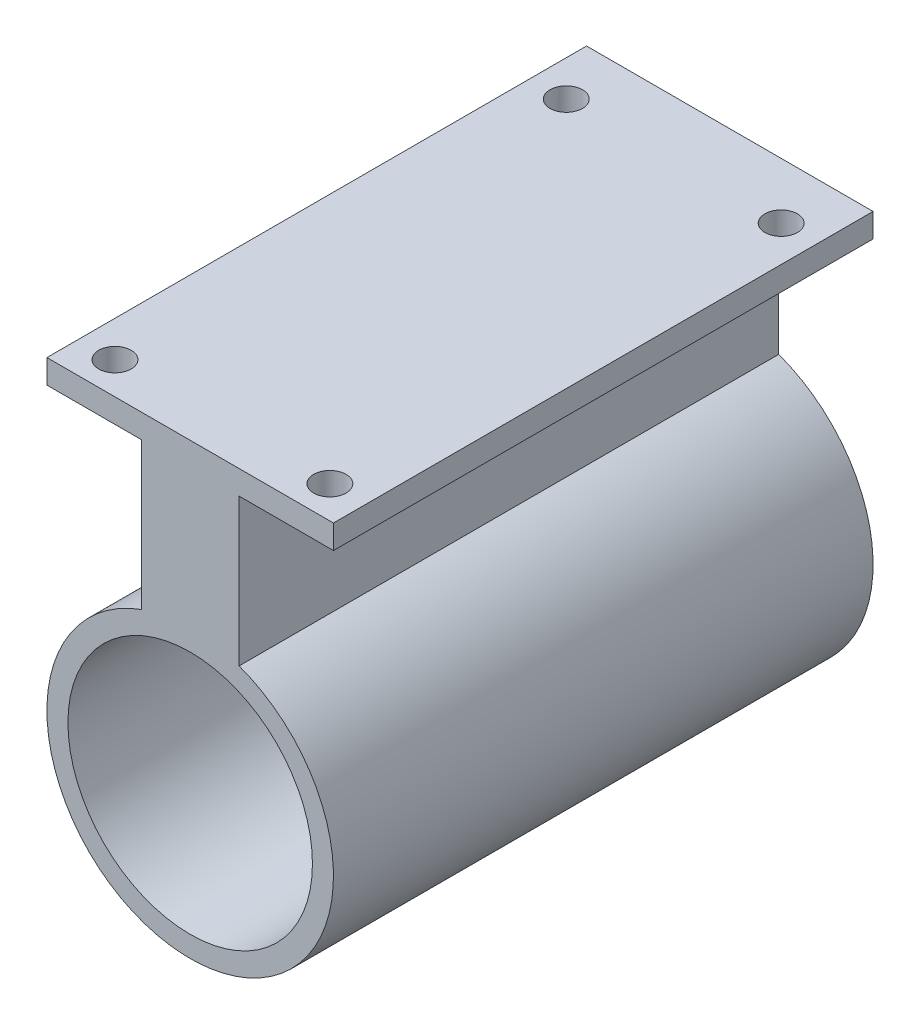
ISO-10303-21;
HEADER;
FILE_DESCRIPTION(('STEP AP214'),'2;1');
FILE_NAME('part.step','',(''),(''),'','','');
FILE_SCHEMA(('AUTOMOTIVE_DESIGN { 1 0 10303 214 1 1 1 1 }'));
ENDSEC;
DATA;
#1=APPLICATION_CONTEXT('core data for automotive mechanical design processes');
#2=APPLICATION_PROTOCOL_DEFINITION('international standard','automotive_design',2000,#1);
#3=PRODUCT_CONTEXT('',#1,'mechanical');
#4=PRODUCT('Part','Part','',(#3));
#5=PRODUCT_RELATED_PRODUCT_CATEGORY('part','',(#4));
#6=PRODUCT_DEFINITION_FORMATION('','',#4);
#7=PRODUCT_DEFINITION_CONTEXT('part definition',#1,'design');
#8=PRODUCT_DEFINITION('design','',#6,#7);
#9=PRODUCT_DEFINITION_SHAPE('','',#8);
#10=(LENGTH_UNIT() NAMED_UNIT(*) SI_UNIT(.MILLI.,.METRE.));
#11=(NAMED_UNIT(*) PLANE_ANGLE_UNIT() SI_UNIT($,.RADIAN.));
#12=(NAMED_UNIT(*) SI_UNIT($,.STERADIAN.) SOLID_ANGLE_UNIT());
#13=UNCERTAINTY_MEASURE_WITH_UNIT(LENGTH_MEASURE(1.E-05),#10,'distance_accuracy_value','');
#14=(GEOMETRIC_REPRESENTATION_CONTEXT(3) GLOBAL_UNCERTAINTY_ASSIGNED_CONTEXT((#13)) GLOBAL_UNIT_ASSIGNED_CONTEXT((#10,
#11,#12)) REPRESENTATION_CONTEXT('',''));
#15=CARTESIAN_POINT('',(0.,0.,0.));
#16=DIRECTION('',(0.,0.,1.));
#17=DIRECTION('',(1.,0.,0.));
#18=AXIS2_PLACEMENT_3D('',#15,#16,#17);
#19=CARTESIAN_POINT('',(0.,-30.75,54.));
#20=DIRECTION('',(0.,0.,-1.));
#21=DIRECTION('',(-1.,0.,0.));
#22=AXIS2_PLACEMENT_3D('',#19,#20,#21);
#23=CYLINDRICAL_SURFACE('',#22,15.);
#24=CARTESIAN_POINT('',(0.,-30.75,-2.5));
#25=DIRECTION('',(0.,0.,-1.));
#26=DIRECTION('',(-1.,0.,0.));
#27=AXIS2_PLACEMENT_3D('',#24,#25,#26);
#28=CIRCLE('',#27,15.);
#29=CARTESIAN_POINT('',(5.11989742878924,-16.6508280271969,-2.5));
#30=VERTEX_POINT('',#29);
#31=CARTESIAN_POINT('',(-5.11989742878925,-16.6508280271969,-2.5));
#32=VERTEX_POINT('',#31);
#33=EDGE_CURVE('E150',#30,#32,#28,.T.);
#34=ORIENTED_EDGE('',*,*,#33,.F.);
#35=DIRECTION('',(0.,0.,-1.));
#36=VECTOR('',#35,1.);
#37=CARTESIAN_POINT('',(5.11989742878925,-16.6508280271969,54.));
#38=LINE('',#37,#36);
#39=CARTESIAN_POINT('',(5.11989742878925,-16.6508280271969,54.));
#40=VERTEX_POINT('',#39);
#41=EDGE_CURVE('E51',#40,#30,#38,.T.);
#42=ORIENTED_EDGE('',*,*,#41,.F.);
#43=CARTESIAN_POINT('',(0.,-30.75,54.));
#44=DIRECTION('',(0.,0.,1.));
#45=DIRECTION('',(1.,0.,0.));
#46=AXIS2_PLACEMENT_3D('',#43,#44,#45);
#47=CIRCLE('',#46,15.);
#48=CARTESIAN_POINT('',(-5.11989742878925,-16.6508280271969,54.));
#49=VERTEX_POINT('',#48);
#50=EDGE_CURVE('E160',#49,#40,#47,.T.);
#51=ORIENTED_EDGE('',*,*,#50,.F.);
#52=DIRECTION('',(0.,0.,-1.));
#53=VECTOR('',#52,1.);
#54=CARTESIAN_POINT('',(-5.11989742878925,-16.6508280271969,54.));
#55=LINE('',#54,#53);
#56=EDGE_CURVE('E172',#49,#32,#55,.T.);
#57=ORIENTED_EDGE('',*,*,#56,.T.);
#58=EDGE_LOOP('',(#34,#42,#51,#57));
#59=FACE_BOUND('',#58,.T.);
#60=ADVANCED_FACE('F34',(#59),#23,.T.);
#61=CARTESIAN_POINT('',(0.,-30.75,54.));
#62=DIRECTION('',(0.,0.,1.));
#63=DIRECTION('',(1.,0.,0.));
#64=AXIS2_PLACEMENT_3D('',#61,#62,#63);
#65=PLANE('',#64);
#66=CARTESIAN_POINT('',(0.,-30.75,54.));
#67=DIRECTION('',(0.,0.,1.));
#68=DIRECTION('',(1.,0.,0.));
#69=AXIS2_PLACEMENT_3D('',#66,#67,#68);
#70=CIRCLE('',#69,12.8);
#71=CARTESIAN_POINT('',(12.8,-30.75,54.));
#72=VERTEX_POINT('',#71);
#73=EDGE_CURVE('E132',#72,#72,#70,.T.);
#74=ORIENTED_EDGE('',*,*,#73,.F.);
#75=EDGE_LOOP('',(#74));
#76=FACE_BOUND('',#75,.T.);
#77=DIRECTION('',(0.,-1.,0.));
#78=VECTOR('',#77,1.);
#79=CARTESIAN_POINT('',(-15.,-1.25,54.));
#80=LINE('',#79,#78);
#81=CARTESIAN_POINT('',(-15.,1.25,54.));
#82=VERTEX_POINT('',#81);
#83=CARTESIAN_POINT('',(-15.,-1.25,54.));
#84=VERTEX_POINT('',#83);
#85=EDGE_CURVE('E154',#82,#84,#80,.T.);
#86=ORIENTED_EDGE('',*,*,#85,.T.);
#87=DIRECTION('',(1.,0.,0.));
#88=VECTOR('',#87,1.);
#89=CARTESIAN_POINT('',(-5.11989742878925,-1.25,54.));
#90=LINE('',#89,#88);
#91=CARTESIAN_POINT('',(-5.11989742878925,-1.25,54.));
#92=VERTEX_POINT('',#91);
#93=EDGE_CURVE('E156',#84,#92,#90,.T.);
#94=ORIENTED_EDGE('',*,*,#93,.T.);
#95=DIRECTION('',(0.,-1.,0.));
#96=VECTOR('',#95,1.);
#97=CARTESIAN_POINT('',(-5.11989742878925,-13.25,54.));
#98=LINE('',#97,#96);
#99=EDGE_CURVE('E158',#92,#49,#98,.T.);
#100=ORIENTED_EDGE('',*,*,#99,.T.);
#101=ORIENTED_EDGE('',*,*,#50,.T.);
#102=DIRECTION('',(0.,1.,0.));
#103=VECTOR('',#102,1.);
#104=CARTESIAN_POINT('',(5.11989742878925,-13.25,54.));
#105=LINE('',#104,#103);
#106=CARTESIAN_POINT('',(5.11989742878925,-1.25,54.));
#107=VERTEX_POINT('',#106);
#108=EDGE_CURVE('E162',#40,#107,#105,.T.);
#109=ORIENTED_EDGE('',*,*,#108,.T.);
#110=DIRECTION('',(1.,0.,0.));
#111=VECTOR('',#110,1.);
#112=CARTESIAN_POINT('',(15.,-1.25,54.));
#113=LINE('',#112,#111);
#114=CARTESIAN_POINT('',(15.,-1.25,54.));
#115=VERTEX_POINT('',#114);
#116=EDGE_CURVE('E164',#107,#115,#113,.T.);
#117=ORIENTED_EDGE('',*,*,#116,.T.);
#118=DIRECTION('',(0.,1.,0.));
#119=VECTOR('',#118,1.);
#120=CARTESIAN_POINT('',(15.,-1.25,54.));
#121=LINE('',#120,#119);
#122=CARTESIAN_POINT('',(15.,1.25,54.));
#123=VERTEX_POINT('',#122);
#124=EDGE_CURVE('E110',#115,#123,#121,.T.);
#125=ORIENTED_EDGE('',*,*,#124,.T.);
#126=DIRECTION('',(-1.,0.,0.));
#127=VECTOR('',#126,1.);
#128=CARTESIAN_POINT('',(15.,1.25,54.));
#129=LINE('',#128,#127);
#130=EDGE_CURVE('E59',#123,#82,#129,.T.);
#131=ORIENTED_EDGE('',*,*,#130,.T.);
#132=EDGE_LOOP('',(#86,#94,#100,#101,#109,#117,#125,#131));
#133=FACE_BOUND('',#132,.T.);
#134=ADVANCED_FACE('F187',(#76,#133),#65,.T.);
#135=CARTESIAN_POINT('',(-15.,-1.25,54.));
#136=DIRECTION('',(1.,0.,0.));
#137=DIRECTION('',(0.,0.,-1.));
#138=AXIS2_PLACEMENT_3D('',#135,#136,#137);
#139=PLANE('',#138);
#140=DIRECTION('',(0.,0.,-1.));
#141=VECTOR('',#140,1.);
#142=CARTESIAN_POINT('',(-15.,1.25,54.));
#143=LINE('',#142,#141);
#144=CARTESIAN_POINT('',(-15.,1.25,-2.5));
#145=VERTEX_POINT('',#144);
#146=EDGE_CURVE('E168',#82,#145,#143,.T.);
#147=ORIENTED_EDGE('',*,*,#146,.T.);
#148=DIRECTION('',(0.,1.,0.));
#149=VECTOR('',#148,1.);
#150=CARTESIAN_POINT('',(-15.,1.25,-2.5));
#151=LINE('',#150,#149);
#152=CARTESIAN_POINT('',(-15.,-1.25,-2.5));
#153=VERTEX_POINT('',#152);
#154=EDGE_CURVE('E143',#153,#145,#151,.T.);
#155=ORIENTED_EDGE('',*,*,#154,.F.);
#156=DIRECTION('',(0.,0.,-1.));
#157=VECTOR('',#156,1.);
#158=CARTESIAN_POINT('',(-15.,-1.25,54.));
#159=LINE('',#158,#157);
#160=EDGE_CURVE('E11',#84,#153,#159,.T.);
#161=ORIENTED_EDGE('',*,*,#160,.F.);
#162=ORIENTED_EDGE('',*,*,#85,.F.);
#163=EDGE_LOOP('',(#147,#155,#161,#162));
#164=FACE_BOUND('',#163,.T.);
#165=ADVANCED_FACE('F36',(#164),#139,.F.);
#166=CARTESIAN_POINT('',(-5.11989742878925,-1.25,54.));
#167=DIRECTION('',(0.,1.,0.));
#168=DIRECTION('',(-1.,0.,0.));
#169=AXIS2_PLACEMENT_3D('',#166,#167,#168);
#170=PLANE('',#169);
#171=CARTESIAN_POINT('',(-11.25,-1.25,50.625));
#172=DIRECTION('',(0.,1.,0.));
#173=DIRECTION('',(-1.,0.,0.));
#174=AXIS2_PLACEMENT_3D('',#171,#172,#173);
#175=CIRCLE('',#174,1.7);
#176=CARTESIAN_POINT('',(-12.95,-1.25,50.625));
#177=VERTEX_POINT('',#176);
#178=EDGE_CURVE('E228',#177,#177,#175,.T.);
#179=ORIENTED_EDGE('',*,*,#178,.T.);
#180=EDGE_LOOP('',(#179));
#181=FACE_BOUND('',#180,.T.);
#182=CARTESIAN_POINT('',(-11.25,-1.25,3.375));
#183=DIRECTION('',(0.,1.,0.));
#184=DIRECTION('',(-1.,0.,0.));
#185=AXIS2_PLACEMENT_3D('',#182,#183,#184);
#186=CIRCLE('',#185,1.7);
#187=CARTESIAN_POINT('',(-12.95,-1.25,3.375));
#188=VERTEX_POINT('',#187);
#189=EDGE_CURVE('E231',#188,#188,#186,.T.);
#190=ORIENTED_EDGE('',*,*,#189,.T.);
#191=EDGE_LOOP('',(#190));
#192=FACE_BOUND('',#191,.T.);
#193=ORIENTED_EDGE('',*,*,#160,.T.);
#194=DIRECTION('',(-1.,0.,0.));
#195=VECTOR('',#194,1.);
#196=CARTESIAN_POINT('',(-15.,-1.25,-2.5));
#197=LINE('',#196,#195);
#198=CARTESIAN_POINT('',(-5.11989742878925,-1.25,-2.5));
#199=VERTEX_POINT('',#198);
#200=EDGE_CURVE('E140',#199,#153,#197,.T.);
#201=ORIENTED_EDGE('',*,*,#200,.F.);
#202=DIRECTION('',(0.,0.,-1.));
#203=VECTOR('',#202,1.);
#204=CARTESIAN_POINT('',(-5.11989742878925,-1.25,54.));
#205=LINE('',#204,#203);
#206=EDGE_CURVE('E43',#92,#199,#205,.T.);
#207=ORIENTED_EDGE('',*,*,#206,.F.);
#208=ORIENTED_EDGE('',*,*,#93,.F.);
#209=EDGE_LOOP('',(#193,#201,#207,#208));
#210=FACE_BOUND('',#209,.T.);
#211=ADVANCED_FACE('F191',(#181,#192,#210),#170,.F.);
#212=CARTESIAN_POINT('',(-5.11989742878925,-13.25,54.));
#213=DIRECTION('',(1.,0.,0.));
#214=DIRECTION('',(0.,0.,-1.));
#215=AXIS2_PLACEMENT_3D('',#212,#213,#214);
#216=PLANE('',#215);
#217=ORIENTED_EDGE('',*,*,#206,.T.);
#218=DIRECTION('',(0.,1.,0.));
#219=VECTOR('',#218,1.);
#220=CARTESIAN_POINT('',(-5.11989742878925,-1.25,-2.5));
#221=LINE('',#220,#219);
#222=EDGE_CURVE('E137',#32,#199,#221,.T.);
#223=ORIENTED_EDGE('',*,*,#222,.F.);
#224=ORIENTED_EDGE('',*,*,#56,.F.);
#225=ORIENTED_EDGE('',*,*,#99,.F.);
#226=EDGE_LOOP('',(#217,#223,#224,#225));
#227=FACE_BOUND('',#226,.T.);
#228=ADVANCED_FACE('F183',(#227),#216,.F.);
#229=CARTESIAN_POINT('',(5.11989742878925,-13.25,54.));
#230=DIRECTION('',(-1.,0.,0.));
#231=DIRECTION('',(0.,0.,1.));
#232=AXIS2_PLACEMENT_3D('',#229,#230,#231);
#233=PLANE('',#232);
#234=ORIENTED_EDGE('',*,*,#41,.T.);
#235=DIRECTION('',(0.,-1.,0.));
#236=VECTOR('',#235,1.);
#237=CARTESIAN_POINT('',(5.11989742878925,-1.25,-2.5));
#238=LINE('',#237,#236);
#239=CARTESIAN_POINT('',(5.11989742878925,-1.25,-2.5));
#240=VERTEX_POINT('',#239);
#241=EDGE_CURVE('E121',#240,#30,#238,.T.);
#242=ORIENTED_EDGE('',*,*,#241,.F.);
#243=DIRECTION('',(0.,0.,-1.));
#244=VECTOR('',#243,1.);
#245=CARTESIAN_POINT('',(5.11989742878925,-1.25,54.));
#246=LINE('',#245,#244);
#247=EDGE_CURVE('E113',#107,#240,#246,.T.);
#248=ORIENTED_EDGE('',*,*,#247,.F.);
#249=ORIENTED_EDGE('',*,*,#108,.F.);
#250=EDGE_LOOP('',(#234,#242,#248,#249));
#251=FACE_BOUND('',#250,.T.);
#252=ADVANCED_FACE('F186',(#251),#233,.F.);
#253=CARTESIAN_POINT('',(15.,-1.25,54.));
#254=DIRECTION('',(0.,1.,0.));
#255=DIRECTION('',(-1.,0.,0.));
#256=AXIS2_PLACEMENT_3D('',#253,#254,#255);
#257=PLANE('',#256);
#258=CARTESIAN_POINT('',(11.25,-1.25,3.375));
#259=DIRECTION('',(0.,1.,0.));
#260=DIRECTION('',(1.,0.,0.));
#261=AXIS2_PLACEMENT_3D('',#258,#259,#260);
#262=CIRCLE('',#261,1.7);
#263=CARTESIAN_POINT('',(12.95,-1.25,3.375));
#264=VERTEX_POINT('',#263);
#265=EDGE_CURVE('E300',#264,#264,#262,.T.);
#266=ORIENTED_EDGE('',*,*,#265,.T.);
#267=EDGE_LOOP('',(#266));
#268=FACE_BOUND('',#267,.T.);
#269=CARTESIAN_POINT('',(11.25,-1.25,50.625));
#270=DIRECTION('',(0.,1.,0.));
#271=DIRECTION('',(1.,0.,0.));
#272=AXIS2_PLACEMENT_3D('',#269,#270,#271);
#273=CIRCLE('',#272,1.7);
#274=CARTESIAN_POINT('',(12.95,-1.25,50.625));
#275=VERTEX_POINT('',#274);
#276=EDGE_CURVE('E307',#275,#275,#273,.T.);
#277=ORIENTED_EDGE('',*,*,#276,.T.);
#278=EDGE_LOOP('',(#277));
#279=FACE_BOUND('',#278,.T.);
#280=ORIENTED_EDGE('',*,*,#247,.T.);
#281=DIRECTION('',(-1.,0.,0.));
#282=VECTOR('',#281,1.);
#283=CARTESIAN_POINT('',(15.,-1.25,-2.5));
#284=LINE('',#283,#282);
#285=CARTESIAN_POINT('',(15.,-1.25,-2.5));
#286=VERTEX_POINT('',#285);
#287=EDGE_CURVE('E117',#286,#240,#284,.T.);
#288=ORIENTED_EDGE('',*,*,#287,.F.);
#289=DIRECTION('',(0.,0.,-1.));
#290=VECTOR('',#289,1.);
#291=CARTESIAN_POINT('',(15.,-1.25,54.));
#292=LINE('',#291,#290);
#293=EDGE_CURVE('E104',#115,#286,#292,.T.);
#294=ORIENTED_EDGE('',*,*,#293,.F.);
#295=ORIENTED_EDGE('',*,*,#116,.F.);
#296=EDGE_LOOP('',(#280,#288,#294,#295));
#297=FACE_BOUND('',#296,.T.);
#298=ADVANCED_FACE('F118',(#268,#279,#297),#257,.F.);
#299=CARTESIAN_POINT('',(15.,-1.25,54.));
#300=DIRECTION('',(-1.,0.,0.));
#301=DIRECTION('',(0.,0.,1.));
#302=AXIS2_PLACEMENT_3D('',#299,#300,#301);
#303=PLANE('',#302);
#304=ORIENTED_EDGE('',*,*,#293,.T.);
#305=DIRECTION('',(0.,-1.,0.));
#306=VECTOR('',#305,1.);
#307=CARTESIAN_POINT('',(15.,1.25,-2.5));
#308=LINE('',#307,#306);
#309=CARTESIAN_POINT('',(15.,1.25,-2.5));
#310=VERTEX_POINT('',#309);
#311=EDGE_CURVE('E109',#310,#286,#308,.T.);
#312=ORIENTED_EDGE('',*,*,#311,.F.);
#313=DIRECTION('',(0.,0.,-1.));
#314=VECTOR('',#313,1.);
#315=CARTESIAN_POINT('',(15.,1.25,54.));
#316=LINE('',#315,#314);
#317=EDGE_CURVE('E114',#123,#310,#316,.T.);
#318=ORIENTED_EDGE('',*,*,#317,.F.);
#319=ORIENTED_EDGE('',*,*,#124,.F.);
#320=EDGE_LOOP('',(#304,#312,#318,#319));
#321=FACE_BOUND('',#320,.T.);
#322=ADVANCED_FACE('F106',(#321),#303,.F.);
#323=CARTESIAN_POINT('',(15.,1.25,54.));
#324=DIRECTION('',(0.,-1.,0.));
#325=DIRECTION('',(1.,0.,0.));
#326=AXIS2_PLACEMENT_3D('',#323,#324,#325);
#327=PLANE('',#326);
#328=CARTESIAN_POINT('',(11.25,1.25,3.375));
#329=DIRECTION('',(0.,1.,0.));
#330=DIRECTION('',(1.,0.,0.));
#331=AXIS2_PLACEMENT_3D('',#328,#329,#330);
#332=CIRCLE('',#331,1.7);
#333=CARTESIAN_POINT('',(12.95,1.25,3.375));
#334=VERTEX_POINT('',#333);
#335=EDGE_CURVE('E302',#334,#334,#332,.T.);
#336=ORIENTED_EDGE('',*,*,#335,.F.);
#337=EDGE_LOOP('',(#336));
#338=FACE_BOUND('',#337,.T.);
#339=CARTESIAN_POINT('',(11.25,1.25,50.625));
#340=DIRECTION('',(0.,1.,0.));
#341=DIRECTION('',(1.,0.,0.));
#342=AXIS2_PLACEMENT_3D('',#339,#340,#341);
#343=CIRCLE('',#342,1.7);
#344=CARTESIAN_POINT('',(12.95,1.25,50.625));
#345=VERTEX_POINT('',#344);
#346=EDGE_CURVE('E304',#345,#345,#343,.T.);
#347=ORIENTED_EDGE('',*,*,#346,.F.);
#348=EDGE_LOOP('',(#347));
#349=FACE_BOUND('',#348,.T.);
#350=CARTESIAN_POINT('',(-11.25,1.25,50.625));
#351=DIRECTION('',(0.,1.,0.));
#352=DIRECTION('',(-1.,0.,0.));
#353=AXIS2_PLACEMENT_3D('',#350,#351,#352);
#354=CIRCLE('',#353,1.7);
#355=CARTESIAN_POINT('',(-12.95,1.25,50.625));
#356=VERTEX_POINT('',#355);
#357=EDGE_CURVE('E242',#356,#356,#354,.T.);
#358=ORIENTED_EDGE('',*,*,#357,.F.);
#359=EDGE_LOOP('',(#358));
#360=FACE_BOUND('',#359,.T.);
#361=CARTESIAN_POINT('',(-11.25,1.25,3.375));
#362=DIRECTION('',(0.,1.,0.));
#363=DIRECTION('',(-1.,0.,0.));
#364=AXIS2_PLACEMENT_3D('',#361,#362,#363);
#365=CIRCLE('',#364,1.7);
#366=CARTESIAN_POINT('',(-12.95,1.25,3.375));
#367=VERTEX_POINT('',#366);
#368=EDGE_CURVE('E234',#367,#367,#365,.T.);
#369=ORIENTED_EDGE('',*,*,#368,.F.);
#370=EDGE_LOOP('',(#369));
#371=FACE_BOUND('',#370,.T.);
#372=ORIENTED_EDGE('',*,*,#317,.T.);
#373=DIRECTION('',(1.,0.,0.));
#374=VECTOR('',#373,1.);
#375=CARTESIAN_POINT('',(15.,1.25,-2.5));
#376=LINE('',#375,#374);
#377=EDGE_CURVE('E128',#145,#310,#376,.T.);
#378=ORIENTED_EDGE('',*,*,#377,.F.);
#379=ORIENTED_EDGE('',*,*,#146,.F.);
#380=ORIENTED_EDGE('',*,*,#130,.F.);
#381=EDGE_LOOP('',(#372,#378,#379,#380));
#382=FACE_BOUND('',#381,.T.);
#383=ADVANCED_FACE('F195',(#338,#349,#360,#371,#382),#327,.F.);
#384=CARTESIAN_POINT('',(0.,-30.75,-2.5));
#385=DIRECTION('',(0.,0.,-1.));
#386=DIRECTION('',(-1.,0.,0.));
#387=AXIS2_PLACEMENT_3D('',#384,#385,#386);
#388=PLANE('',#387);
#389=CARTESIAN_POINT('',(0.,-39.25,-2.5));
#390=DIRECTION('',(0.,0.,-1.));
#391=DIRECTION('',(-1.,0.,0.));
#392=AXIS2_PLACEMENT_3D('',#389,#390,#391);
#393=CIRCLE('',#392,1.7);
#394=CARTESIAN_POINT('',(-1.69999999999999,-39.25,-2.5));
#395=VERTEX_POINT('',#394);
#396=EDGE_CURVE('E233',#395,#395,#393,.T.);
#397=ORIENTED_EDGE('',*,*,#396,.F.);
#398=EDGE_LOOP('',(#397));
#399=FACE_BOUND('',#398,.T.);
#400=CARTESIAN_POINT('',(0.,-22.25,-2.5));
#401=DIRECTION('',(0.,0.,-1.));
#402=DIRECTION('',(-1.,0.,0.));
#403=AXIS2_PLACEMENT_3D('',#400,#401,#402);
#404=CIRCLE('',#403,1.7);
#405=CARTESIAN_POINT('',(-1.7,-22.25,-2.5));
#406=VERTEX_POINT('',#405);
#407=EDGE_CURVE('E246',#406,#406,#404,.T.);
#408=ORIENTED_EDGE('',*,*,#407,.F.);
#409=EDGE_LOOP('',(#408));
#410=FACE_BOUND('',#409,.T.);
#411=CARTESIAN_POINT('',(0.,-30.75,-2.5));
#412=DIRECTION('',(0.,0.,-1.));
#413=DIRECTION('',(-1.,0.,0.));
#414=AXIS2_PLACEMENT_3D('',#411,#412,#413);
#415=CIRCLE('',#414,3.75);
#416=CARTESIAN_POINT('',(-3.74999999999999,-30.75,-2.5));
#417=VERTEX_POINT('',#416);
#418=EDGE_CURVE('E146',#417,#417,#415,.T.);
#419=ORIENTED_EDGE('',*,*,#418,.F.);
#420=EDGE_LOOP('',(#419));
#421=FACE_BOUND('',#420,.T.);
#422=ORIENTED_EDGE('',*,*,#33,.T.);
#423=ORIENTED_EDGE('',*,*,#222,.T.);
#424=ORIENTED_EDGE('',*,*,#200,.T.);
#425=ORIENTED_EDGE('',*,*,#154,.T.);
#426=ORIENTED_EDGE('',*,*,#377,.T.);
#427=ORIENTED_EDGE('',*,*,#311,.T.);
#428=ORIENTED_EDGE('',*,*,#287,.T.);
#429=ORIENTED_EDGE('',*,*,#241,.T.);
#430=EDGE_LOOP('',(#422,#423,#424,#425,#426,#427,#428,#429));
#431=FACE_BOUND('',#430,.T.);
#432=ADVANCED_FACE('F125',(#399,#410,#421,#431),#388,.T.);
#433=CARTESIAN_POINT('',(0.,-30.75,0.));
#434=DIRECTION('',(0.,0.,-1.));
#435=DIRECTION('',(-1.,0.,0.));
#436=AXIS2_PLACEMENT_3D('',#433,#434,#435);
#437=PLANE('',#436);
#438=CARTESIAN_POINT('',(0.,-39.25,0.));
#439=DIRECTION('',(0.,0.,-1.));
#440=DIRECTION('',(-1.,0.,0.));
#441=AXIS2_PLACEMENT_3D('',#438,#439,#440);
#442=CIRCLE('',#441,1.7);
#443=CARTESIAN_POINT('',(-1.69999999999999,-39.25,0.));
#444=VERTEX_POINT('',#443);
#445=EDGE_CURVE('E237',#444,#444,#442,.T.);
#446=ORIENTED_EDGE('',*,*,#445,.T.);
#447=EDGE_LOOP('',(#446));
#448=FACE_BOUND('',#447,.T.);
#449=CARTESIAN_POINT('',(0.,-22.25,0.));
#450=DIRECTION('',(0.,0.,-1.));
#451=DIRECTION('',(-1.,0.,0.));
#452=AXIS2_PLACEMENT_3D('',#449,#450,#451);
#453=CIRCLE('',#452,1.7);
#454=CARTESIAN_POINT('',(-1.7,-22.25,0.));
#455=VERTEX_POINT('',#454);
#456=EDGE_CURVE('E248',#455,#455,#453,.T.);
#457=ORIENTED_EDGE('',*,*,#456,.T.);
#458=EDGE_LOOP('',(#457));
#459=FACE_BOUND('',#458,.T.);
#460=CARTESIAN_POINT('',(0.,-30.75,0.));
#461=DIRECTION('',(0.,0.,-1.));
#462=DIRECTION('',(-1.,0.,0.));
#463=AXIS2_PLACEMENT_3D('',#460,#461,#462);
#464=CIRCLE('',#463,3.75);
#465=CARTESIAN_POINT('',(-3.74999999999999,-30.75,0.));
#466=VERTEX_POINT('',#465);
#467=EDGE_CURVE('E147',#466,#466,#464,.T.);
#468=ORIENTED_EDGE('',*,*,#467,.T.);
#469=EDGE_LOOP('',(#468));
#470=FACE_BOUND('',#469,.T.);
#471=CARTESIAN_POINT('',(0.,-30.75,0.));
#472=DIRECTION('',(0.,0.,1.));
#473=DIRECTION('',(1.,0.,0.));
#474=AXIS2_PLACEMENT_3D('',#471,#472,#473);
#475=CIRCLE('',#474,12.8);
#476=CARTESIAN_POINT('',(12.8,-30.75,0.));
#477=VERTEX_POINT('',#476);
#478=EDGE_CURVE('E129',#477,#477,#475,.T.);
#479=ORIENTED_EDGE('',*,*,#478,.T.);
#480=EDGE_LOOP('',(#479));
#481=FACE_BOUND('',#480,.T.);
#482=ADVANCED_FACE('F203',(#448,#459,#470,#481),#437,.F.);
#483=CARTESIAN_POINT('',(0.,-30.75,0.));
#484=DIRECTION('',(0.,0.,-1.));
#485=DIRECTION('',(-1.,0.,0.));
#486=AXIS2_PLACEMENT_3D('',#483,#484,#485);
#487=CYLINDRICAL_SURFACE('',#486,3.75);
#488=ORIENTED_EDGE('',*,*,#467,.F.);
#489=EDGE_LOOP('',(#488));
#490=FACE_BOUND('',#489,.T.);
#491=ORIENTED_EDGE('',*,*,#418,.T.);
#492=EDGE_LOOP('',(#491));
#493=FACE_BOUND('',#492,.T.);
#494=ADVANCED_FACE('F259',(#490,#493),#487,.F.);
#495=CARTESIAN_POINT('',(0.,-30.75,0.));
#496=DIRECTION('',(0.,0.,1.));
#497=DIRECTION('',(1.,0.,0.));
#498=AXIS2_PLACEMENT_3D('',#495,#496,#497);
#499=CYLINDRICAL_SURFACE('',#498,12.8);
#500=ORIENTED_EDGE('',*,*,#478,.F.);
#501=EDGE_LOOP('',(#500));
#502=FACE_BOUND('',#501,.T.);
#503=ORIENTED_EDGE('',*,*,#73,.T.);
#504=EDGE_LOOP('',(#503));
#505=FACE_BOUND('',#504,.T.);
#506=ADVANCED_FACE('F261',(#502,#505),#499,.F.);
#507=CARTESIAN_POINT('',(0.,-22.25,0.));
#508=DIRECTION('',(0.,0.,-1.));
#509=DIRECTION('',(-1.,0.,0.));
#510=AXIS2_PLACEMENT_3D('',#507,#508,#509);
#511=CYLINDRICAL_SURFACE('',#510,1.7);
#512=ORIENTED_EDGE('',*,*,#456,.F.);
#513=EDGE_LOOP('',(#512));
#514=FACE_BOUND('',#513,.T.);
#515=ORIENTED_EDGE('',*,*,#407,.T.);
#516=EDGE_LOOP('',(#515));
#517=FACE_BOUND('',#516,.T.);
#518=ADVANCED_FACE('F254',(#514,#517),#511,.F.);
#519=CARTESIAN_POINT('',(0.,-39.25,0.));
#520=DIRECTION('',(0.,0.,-1.));
#521=DIRECTION('',(-1.,0.,0.));
#522=AXIS2_PLACEMENT_3D('',#519,#520,#521);
#523=CYLINDRICAL_SURFACE('',#522,1.7);
#524=ORIENTED_EDGE('',*,*,#445,.F.);
#525=EDGE_LOOP('',(#524));
#526=FACE_BOUND('',#525,.T.);
#527=ORIENTED_EDGE('',*,*,#396,.T.);
#528=EDGE_LOOP('',(#527));
#529=FACE_BOUND('',#528,.T.);
#530=ADVANCED_FACE('F276',(#526,#529),#523,.F.);
#531=CARTESIAN_POINT('',(-11.25,-1.25,3.375));
#532=DIRECTION('',(0.,1.,0.));
#533=DIRECTION('',(-1.,0.,0.));
#534=AXIS2_PLACEMENT_3D('',#531,#532,#533);
#535=CYLINDRICAL_SURFACE('',#534,1.7);
#536=ORIENTED_EDGE('',*,*,#189,.F.);
#537=EDGE_LOOP('',(#536));
#538=FACE_BOUND('',#537,.T.);
#539=ORIENTED_EDGE('',*,*,#368,.T.);
#540=EDGE_LOOP('',(#539));
#541=FACE_BOUND('',#540,.T.);
#542=ADVANCED_FACE('F280',(#538,#541),#535,.F.);
#543=CARTESIAN_POINT('',(-11.25,-1.25,50.625));
#544=DIRECTION('',(0.,1.,0.));
#545=DIRECTION('',(-1.,0.,0.));
#546=AXIS2_PLACEMENT_3D('',#543,#544,#545);
#547=CYLINDRICAL_SURFACE('',#546,1.7);
#548=ORIENTED_EDGE('',*,*,#178,.F.);
#549=EDGE_LOOP('',(#548));
#550=FACE_BOUND('',#549,.T.);
#551=ORIENTED_EDGE('',*,*,#357,.T.);
#552=EDGE_LOOP('',(#551));
#553=FACE_BOUND('',#552,.T.);
#554=ADVANCED_FACE('F284',(#550,#553),#547,.F.);
#555=CARTESIAN_POINT('',(11.25,-1.25,50.625));
#556=DIRECTION('',(0.,1.,0.));
#557=DIRECTION('',(-1.,0.,0.));
#558=AXIS2_PLACEMENT_3D('',#555,#556,#557);
#559=CYLINDRICAL_SURFACE('',#558,1.7);
#560=ORIENTED_EDGE('',*,*,#276,.F.);
#561=EDGE_LOOP('',(#560));
#562=FACE_BOUND('',#561,.T.);
#563=ORIENTED_EDGE('',*,*,#346,.T.);
#564=EDGE_LOOP('',(#563));
#565=FACE_BOUND('',#564,.T.);
#566=ADVANCED_FACE('F287',(#562,#565),#559,.F.);
#567=CARTESIAN_POINT('',(11.25,-1.25,3.375));
#568=DIRECTION('',(0.,1.,0.));
#569=DIRECTION('',(-1.,0.,0.));
#570=AXIS2_PLACEMENT_3D('',#567,#568,#569);
#571=CYLINDRICAL_SURFACE('',#570,1.7);
#572=ORIENTED_EDGE('',*,*,#265,.F.);
#573=EDGE_LOOP('',(#572));
#574=FACE_BOUND('',#573,.T.);
#575=ORIENTED_EDGE('',*,*,#335,.T.);
#576=EDGE_LOOP('',(#575));
#577=FACE_BOUND('',#576,.T.);
#578=ADVANCED_FACE('F291',(#574,#577),#571,.F.);
#579=CLOSED_SHELL('',(#60,#134,#165,#211,#228,#252,#298,#322,#383,#432,#482,#494,#506,#518,#530,
#542,#554,#566,#578));
#580=MANIFOLD_SOLID_BREP('B2',#579);
#581=ADVANCED_BREP_SHAPE_REPRESENTATION('',(#18,#580),#14);
#582=SHAPE_DEFINITION_REPRESENTATION(#9,#581);
ENDSEC;
END-ISO-10303-21;
